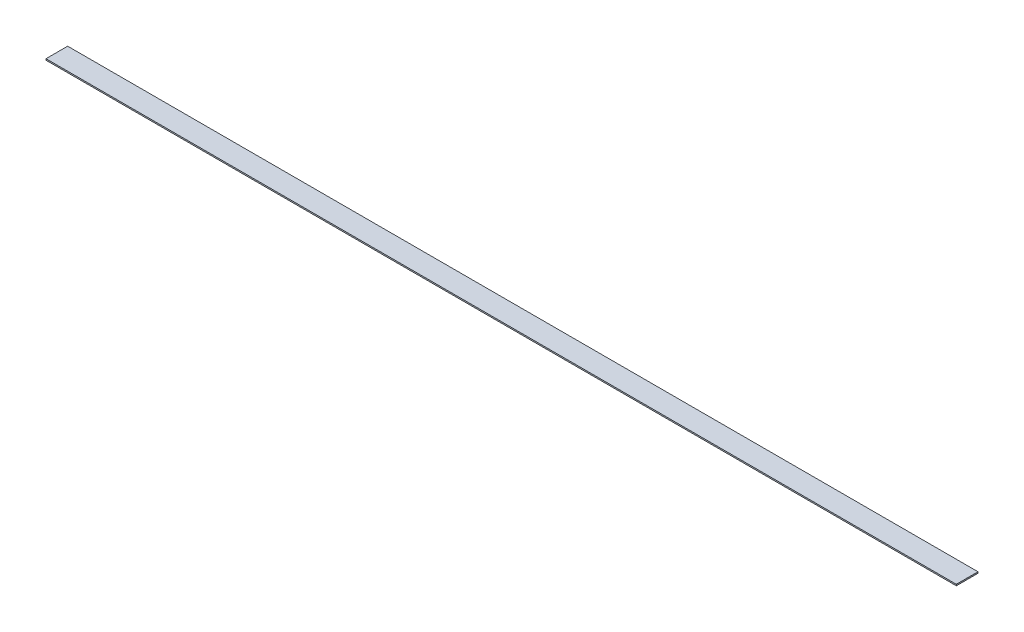
ISO-10303-21;
HEADER;
FILE_DESCRIPTION(('STEP AP214'),'2;1');
FILE_NAME('part.step','',(''),(''),'','','');
FILE_SCHEMA(('AUTOMOTIVE_DESIGN { 1 0 10303 214 1 1 1 1 }'));
ENDSEC;
DATA;
#1=APPLICATION_CONTEXT('core data for automotive mechanical design processes');
#2=APPLICATION_PROTOCOL_DEFINITION('international standard','automotive_design',2000,#1);
#3=PRODUCT_CONTEXT('',#1,'mechanical');
#4=PRODUCT('Part','Part','',(#3));
#5=PRODUCT_RELATED_PRODUCT_CATEGORY('part','',(#4));
#6=PRODUCT_DEFINITION_FORMATION('','',#4);
#7=PRODUCT_DEFINITION_CONTEXT('part definition',#1,'design');
#8=PRODUCT_DEFINITION('design','',#6,#7);
#9=PRODUCT_DEFINITION_SHAPE('','',#8);
#10=(LENGTH_UNIT() NAMED_UNIT(*) SI_UNIT(.MILLI.,.METRE.));
#11=(NAMED_UNIT(*) PLANE_ANGLE_UNIT() SI_UNIT($,.RADIAN.));
#12=(NAMED_UNIT(*) SI_UNIT($,.STERADIAN.) SOLID_ANGLE_UNIT());
#13=UNCERTAINTY_MEASURE_WITH_UNIT(LENGTH_MEASURE(1.E-05),#10,'distance_accuracy_value','');
#14=(GEOMETRIC_REPRESENTATION_CONTEXT(3) GLOBAL_UNCERTAINTY_ASSIGNED_CONTEXT((#13)) GLOBAL_UNIT_ASSIGNED_CONTEXT((#10,
#11,#12)) REPRESENTATION_CONTEXT('',''));
#15=CARTESIAN_POINT('',(0.,0.,0.));
#16=DIRECTION('',(0.,0.,1.));
#17=DIRECTION('',(1.,0.,0.));
#18=AXIS2_PLACEMENT_3D('',#15,#16,#17);
#19=CARTESIAN_POINT('',(0.,1.5875,0.));
#20=DIRECTION('',(1.,0.,0.));
#21=DIRECTION('',(0.,0.,-1.));
#22=AXIS2_PLACEMENT_3D('',#19,#20,#21);
#23=PLANE('',#22);
#24=DIRECTION('',(0.,0.,1.));
#25=VECTOR('',#24,1.);
#26=CARTESIAN_POINT('',(0.,0.,0.));
#27=LINE('',#26,#25);
#28=CARTESIAN_POINT('',(0.,0.,-25.4));
#29=VERTEX_POINT('',#28);
#30=CARTESIAN_POINT('',(0.,0.,0.));
#31=VERTEX_POINT('',#30);
#32=EDGE_CURVE('E95',#29,#31,#27,.T.);
#33=ORIENTED_EDGE('',*,*,#32,.T.);
#34=DIRECTION('',(0.,-1.,0.));
#35=VECTOR('',#34,1.);
#36=CARTESIAN_POINT('',(0.,1.5875,0.));
#37=LINE('',#36,#35);
#38=CARTESIAN_POINT('',(0.,1.5875,0.));
#39=VERTEX_POINT('',#38);
#40=EDGE_CURVE('E11',#39,#31,#37,.T.);
#41=ORIENTED_EDGE('',*,*,#40,.F.);
#42=DIRECTION('',(0.,0.,1.));
#43=VECTOR('',#42,1.);
#44=CARTESIAN_POINT('',(0.,1.5875,0.));
#45=LINE('',#44,#43);
#46=CARTESIAN_POINT('',(0.,1.5875,-25.4));
#47=VERTEX_POINT('',#46);
#48=EDGE_CURVE('E83',#47,#39,#45,.T.);
#49=ORIENTED_EDGE('',*,*,#48,.F.);
#50=DIRECTION('',(0.,-1.,0.));
#51=VECTOR('',#50,1.);
#52=CARTESIAN_POINT('',(0.,1.5875,-25.4));
#53=LINE('',#52,#51);
#54=EDGE_CURVE('E91',#47,#29,#53,.T.);
#55=ORIENTED_EDGE('',*,*,#54,.T.);
#56=EDGE_LOOP('',(#33,#41,#49,#55));
#57=FACE_BOUND('',#56,.T.);
#58=ADVANCED_FACE('F32',(#57),#23,.F.);
#59=CARTESIAN_POINT('',(0.,1.5875,0.));
#60=DIRECTION('',(0.,0.,-1.));
#61=DIRECTION('',(-1.,0.,0.));
#62=AXIS2_PLACEMENT_3D('',#59,#60,#61);
#63=PLANE('',#62);
#64=DIRECTION('',(1.,0.,0.));
#65=VECTOR('',#64,1.);
#66=CARTESIAN_POINT('',(0.,0.,0.));
#67=LINE('',#66,#65);
#68=CARTESIAN_POINT('',(1066.8,0.,0.));
#69=VERTEX_POINT('',#68);
#70=EDGE_CURVE('E87',#31,#69,#67,.T.);
#71=ORIENTED_EDGE('',*,*,#70,.T.);
#72=DIRECTION('',(0.,-1.,0.));
#73=VECTOR('',#72,1.);
#74=CARTESIAN_POINT('',(1066.8,1.5875,0.));
#75=LINE('',#74,#73);
#76=CARTESIAN_POINT('',(1066.8,1.5875,0.));
#77=VERTEX_POINT('',#76);
#78=EDGE_CURVE('E40',#77,#69,#75,.T.);
#79=ORIENTED_EDGE('',*,*,#78,.F.);
#80=DIRECTION('',(1.,0.,0.));
#81=VECTOR('',#80,1.);
#82=CARTESIAN_POINT('',(0.,1.5875,0.));
#83=LINE('',#82,#81);
#84=EDGE_CURVE('E78',#39,#77,#83,.T.);
#85=ORIENTED_EDGE('',*,*,#84,.F.);
#86=ORIENTED_EDGE('',*,*,#40,.T.);
#87=EDGE_LOOP('',(#71,#79,#85,#86));
#88=FACE_BOUND('',#87,.T.);
#89=ADVANCED_FACE('F86',(#88),#63,.F.);
#90=CARTESIAN_POINT('',(1066.8,1.5875,0.));
#91=DIRECTION('',(-1.,0.,0.));
#92=DIRECTION('',(0.,0.,1.));
#93=AXIS2_PLACEMENT_3D('',#90,#91,#92);
#94=PLANE('',#93);
#95=DIRECTION('',(0.,0.,-1.));
#96=VECTOR('',#95,1.);
#97=CARTESIAN_POINT('',(1066.8,0.,0.));
#98=LINE('',#97,#96);
#99=CARTESIAN_POINT('',(1066.8,0.,-25.4));
#100=VERTEX_POINT('',#99);
#101=EDGE_CURVE('E65',#69,#100,#98,.T.);
#102=ORIENTED_EDGE('',*,*,#101,.T.);
#103=DIRECTION('',(0.,-1.,0.));
#104=VECTOR('',#103,1.);
#105=CARTESIAN_POINT('',(1066.8,1.5875,-25.4));
#106=LINE('',#105,#104);
#107=CARTESIAN_POINT('',(1066.8,1.5875,-25.4));
#108=VERTEX_POINT('',#107);
#109=EDGE_CURVE('E88',#108,#100,#106,.T.);
#110=ORIENTED_EDGE('',*,*,#109,.F.);
#111=DIRECTION('',(0.,0.,-1.));
#112=VECTOR('',#111,1.);
#113=CARTESIAN_POINT('',(1066.8,1.5875,0.));
#114=LINE('',#113,#112);
#115=EDGE_CURVE('E81',#77,#108,#114,.T.);
#116=ORIENTED_EDGE('',*,*,#115,.F.);
#117=ORIENTED_EDGE('',*,*,#78,.T.);
#118=EDGE_LOOP('',(#102,#110,#116,#117));
#119=FACE_BOUND('',#118,.T.);
#120=ADVANCED_FACE('F89',(#119),#94,.F.);
#121=CARTESIAN_POINT('',(0.,1.5875,-25.4));
#122=DIRECTION('',(0.,0.,1.));
#123=DIRECTION('',(1.,0.,0.));
#124=AXIS2_PLACEMENT_3D('',#121,#122,#123);
#125=PLANE('',#124);
#126=DIRECTION('',(-1.,0.,0.));
#127=VECTOR('',#126,1.);
#128=CARTESIAN_POINT('',(0.,0.,-25.4));
#129=LINE('',#128,#127);
#130=EDGE_CURVE('E71',#100,#29,#129,.T.);
#131=ORIENTED_EDGE('',*,*,#130,.T.);
#132=ORIENTED_EDGE('',*,*,#54,.F.);
#133=DIRECTION('',(-1.,0.,0.));
#134=VECTOR('',#133,1.);
#135=CARTESIAN_POINT('',(0.,1.5875,-25.4));
#136=LINE('',#135,#134);
#137=EDGE_CURVE('E48',#108,#47,#136,.T.);
#138=ORIENTED_EDGE('',*,*,#137,.F.);
#139=ORIENTED_EDGE('',*,*,#109,.T.);
#140=EDGE_LOOP('',(#131,#132,#138,#139));
#141=FACE_BOUND('',#140,.T.);
#142=ADVANCED_FACE('F102',(#141),#125,.F.);
#143=CARTESIAN_POINT('',(0.,1.5875,0.));
#144=DIRECTION('',(0.,-1.,0.));
#145=DIRECTION('',(0.,0.,-1.));
#146=AXIS2_PLACEMENT_3D('',#143,#144,#145);
#147=PLANE('',#146);
#148=ORIENTED_EDGE('',*,*,#48,.T.);
#149=ORIENTED_EDGE('',*,*,#84,.T.);
#150=ORIENTED_EDGE('',*,*,#115,.T.);
#151=ORIENTED_EDGE('',*,*,#137,.T.);
#152=EDGE_LOOP('',(#148,#149,#150,#151));
#153=FACE_BOUND('',#152,.T.);
#154=ADVANCED_FACE('F79',(#153),#147,.F.);
#155=CARTESIAN_POINT('',(0.,0.,0.));
#156=DIRECTION('',(0.,-1.,0.));
#157=DIRECTION('',(0.,0.,-1.));
#158=AXIS2_PLACEMENT_3D('',#155,#156,#157);
#159=PLANE('',#158);
#160=ORIENTED_EDGE('',*,*,#32,.F.);
#161=ORIENTED_EDGE('',*,*,#130,.F.);
#162=ORIENTED_EDGE('',*,*,#101,.F.);
#163=ORIENTED_EDGE('',*,*,#70,.F.);
#164=EDGE_LOOP('',(#160,#161,#162,#163));
#165=FACE_BOUND('',#164,.T.);
#166=ADVANCED_FACE('F105',(#165),#159,.T.);
#167=CLOSED_SHELL('',(#58,#89,#120,#142,#154,#166));
#168=MANIFOLD_SOLID_BREP('B2',#167);
#169=ADVANCED_BREP_SHAPE_REPRESENTATION('',(#18,#168),#14);
#170=SHAPE_DEFINITION_REPRESENTATION(#9,#169);
ENDSEC;
END-ISO-10303-21;
